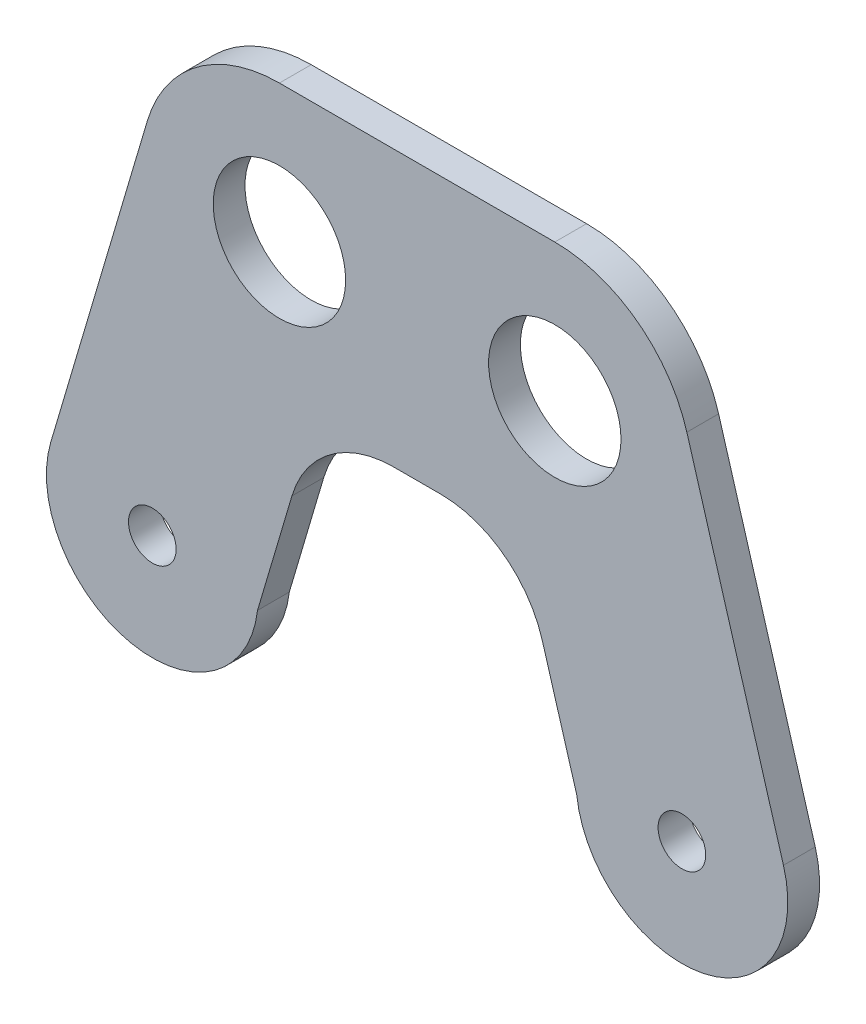
ISO-10303-21;
HEADER;
FILE_DESCRIPTION(('STEP AP214'),'2;1');
FILE_NAME('part.step','',(''),(''),'','','');
FILE_SCHEMA(('AUTOMOTIVE_DESIGN { 1 0 10303 214 1 1 1 1 }'));
ENDSEC;
DATA;
#1=APPLICATION_CONTEXT('core data for automotive mechanical design processes');
#2=APPLICATION_PROTOCOL_DEFINITION('international standard','automotive_design',2000,#1);
#3=PRODUCT_CONTEXT('',#1,'mechanical');
#4=PRODUCT('Part','Part','',(#3));
#5=PRODUCT_RELATED_PRODUCT_CATEGORY('part','',(#4));
#6=PRODUCT_DEFINITION_FORMATION('','',#4);
#7=PRODUCT_DEFINITION_CONTEXT('part definition',#1,'design');
#8=PRODUCT_DEFINITION('design','',#6,#7);
#9=PRODUCT_DEFINITION_SHAPE('','',#8);
#10=(LENGTH_UNIT() NAMED_UNIT(*) SI_UNIT(.MILLI.,.METRE.));
#11=(NAMED_UNIT(*) PLANE_ANGLE_UNIT() SI_UNIT($,.RADIAN.));
#12=(NAMED_UNIT(*) SI_UNIT($,.STERADIAN.) SOLID_ANGLE_UNIT());
#13=UNCERTAINTY_MEASURE_WITH_UNIT(LENGTH_MEASURE(1.E-05),#10,'distance_accuracy_value','');
#14=(GEOMETRIC_REPRESENTATION_CONTEXT(3) GLOBAL_UNCERTAINTY_ASSIGNED_CONTEXT((#13)) GLOBAL_UNIT_ASSIGNED_CONTEXT((#10,
#11,#12)) REPRESENTATION_CONTEXT('',''));
#15=CARTESIAN_POINT('',(0.,0.,0.));
#16=DIRECTION('',(0.,0.,1.));
#17=DIRECTION('',(1.,0.,0.));
#18=AXIS2_PLACEMENT_3D('',#15,#16,#17);
#19=CARTESIAN_POINT('',(12.,17.,3.));
#20=DIRECTION('',(0.,1.,0.));
#21=DIRECTION('',(0.,0.,1.));
#22=AXIS2_PLACEMENT_3D('',#19,#20,#21);
#23=PLANE('',#22);
#24=DIRECTION('',(1.,0.,0.));
#25=VECTOR('',#24,1.);
#26=CARTESIAN_POINT('',(12.,17.,0.));
#27=LINE('',#26,#25);
#28=CARTESIAN_POINT('',(22.7724449466976,17.,0.));
#29=VERTEX_POINT('',#28);
#30=CARTESIAN_POINT('',(27.2275550533024,17.,0.));
#31=VERTEX_POINT('',#30);
#32=EDGE_CURVE('E216',#29,#31,#27,.T.);
#33=ORIENTED_EDGE('',*,*,#32,.T.);
#34=DIRECTION('',(0.,0.,1.));
#35=VECTOR('',#34,1.);
#36=CARTESIAN_POINT('',(27.2275550533024,17.,3.));
#37=LINE('',#36,#35);
#38=CARTESIAN_POINT('',(27.2275550533024,17.,3.));
#39=VERTEX_POINT('',#38);
#40=EDGE_CURVE('E274',#31,#39,#37,.T.);
#41=ORIENTED_EDGE('',*,*,#40,.T.);
#42=DIRECTION('',(1.,0.,0.));
#43=VECTOR('',#42,1.);
#44=CARTESIAN_POINT('',(12.,17.,3.));
#45=LINE('',#44,#43);
#46=CARTESIAN_POINT('',(22.7724449466976,17.,3.));
#47=VERTEX_POINT('',#46);
#48=EDGE_CURVE('E202',#47,#39,#45,.T.);
#49=ORIENTED_EDGE('',*,*,#48,.F.);
#50=DIRECTION('',(0.,0.,1.));
#51=VECTOR('',#50,1.);
#52=CARTESIAN_POINT('',(22.7724449466976,17.,3.));
#53=LINE('',#52,#51);
#54=EDGE_CURVE('E268',#47,#29,#53,.F.);
#55=ORIENTED_EDGE('',*,*,#54,.T.);
#56=EDGE_LOOP('',(#33,#41,#49,#55));
#57=FACE_BOUND('',#56,.T.);
#58=ADVANCED_FACE('F39',(#57),#23,.F.);
#59=CARTESIAN_POINT('',(0.,0.,3.));
#60=DIRECTION('',(0.,0.,1.));
#61=DIRECTION('',(1.,0.,0.));
#62=AXIS2_PLACEMENT_3D('',#59,#60,#61);
#63=PLANE('',#62);
#64=CARTESIAN_POINT('',(0.,0.,3.));
#65=DIRECTION('',(0.,0.,1.));
#66=DIRECTION('',(1.,0.,0.));
#67=AXIS2_PLACEMENT_3D('',#64,#65,#66);
#68=CIRCLE('',#67,10.);
#69=CARTESIAN_POINT('',(-9.58948732307208,2.83579492922883,3.));
#70=VERTEX_POINT('',#69);
#71=CARTESIAN_POINT('',(9.93327257681354,-1.15329784302411,3.));
#72=VERTEX_POINT('',#71);
#73=EDGE_CURVE('E264',#70,#72,#68,.T.);
#74=ORIENTED_EDGE('',*,*,#73,.T.);
#75=DIRECTION('',(0.283579492922883,0.958948732307208,0.));
#76=VECTOR('',#75,1.);
#77=CARTESIAN_POINT('',(9.44809106389425,-2.79398134928659,3.));
#78=LINE('',#77,#76);
#79=CARTESIAN_POINT('',(13.1829576236255,9.83579492922883,3.));
#80=VERTEX_POINT('',#79);
#81=EDGE_CURVE('E231',#72,#80,#78,.T.);
#82=ORIENTED_EDGE('',*,*,#81,.T.);
#83=CARTESIAN_POINT('',(22.7724449466976,7.,3.));
#84=DIRECTION('',(0.,0.,1.));
#85=DIRECTION('',(1.,0.,0.));
#86=AXIS2_PLACEMENT_3D('',#83,#84,#85);
#87=CIRCLE('',#86,10.);
#88=EDGE_CURVE('E48',#80,#47,#87,.F.);
#89=ORIENTED_EDGE('',*,*,#88,.T.);
#90=ORIENTED_EDGE('',*,*,#48,.T.);
#91=CARTESIAN_POINT('',(27.2275550533024,7.,3.));
#92=DIRECTION('',(0.,0.,1.));
#93=DIRECTION('',(1.,0.,0.));
#94=AXIS2_PLACEMENT_3D('',#91,#92,#93);
#95=CIRCLE('',#94,10.);
#96=CARTESIAN_POINT('',(36.8170423763745,9.83579492922883,3.));
#97=VERTEX_POINT('',#96);
#98=EDGE_CURVE('E284',#39,#97,#95,.F.);
#99=ORIENTED_EDGE('',*,*,#98,.T.);
#100=DIRECTION('',(-0.283579492922883,0.958948732307208,0.));
#101=VECTOR('',#100,1.);
#102=CARTESIAN_POINT('',(36.5310424957858,10.8029284130494,3.));
#103=LINE('',#102,#101);
#104=CARTESIAN_POINT('',(40.0667274231865,-1.15329784302412,3.));
#105=VERTEX_POINT('',#104);
#106=EDGE_CURVE('E163',#105,#97,#103,.T.);
#107=ORIENTED_EDGE('',*,*,#106,.F.);
#108=CARTESIAN_POINT('',(50.,0.,3.));
#109=DIRECTION('',(0.,0.,1.));
#110=DIRECTION('',(1.,0.,0.));
#111=AXIS2_PLACEMENT_3D('',#108,#109,#110);
#112=CIRCLE('',#111,10.);
#113=CARTESIAN_POINT('',(59.5894873230721,2.83579492922883,3.));
#114=VERTEX_POINT('',#113);
#115=EDGE_CURVE('E158',#105,#114,#112,.T.);
#116=ORIENTED_EDGE('',*,*,#115,.T.);
#117=DIRECTION('',(0.283579492922883,-0.958948732307208,0.));
#118=VECTOR('',#117,1.);
#119=CARTESIAN_POINT('',(55.5686208827521,16.4327046915648,3.));
#120=LINE('',#119,#118);
#121=CARTESIAN_POINT('',(50.4663335199937,33.6865334079975,3.));
#122=VERTEX_POINT('',#121);
#123=EDGE_CURVE('E134',#122,#114,#120,.T.);
#124=ORIENTED_EDGE('',*,*,#123,.F.);
#125=CARTESIAN_POINT('',(38.,30.,3.));
#126=DIRECTION('',(0.,0.,1.));
#127=DIRECTION('',(1.,0.,0.));
#128=AXIS2_PLACEMENT_3D('',#125,#126,#127);
#129=CIRCLE('',#128,13.);
#130=CARTESIAN_POINT('',(38.,43.,3.));
#131=VERTEX_POINT('',#130);
#132=EDGE_CURVE('E207',#122,#131,#129,.T.);
#133=ORIENTED_EDGE('',*,*,#132,.T.);
#134=DIRECTION('',(-1.,0.,0.));
#135=VECTOR('',#134,1.);
#136=CARTESIAN_POINT('',(12.,43.,3.));
#137=LINE('',#136,#135);
#138=CARTESIAN_POINT('',(12.,43.,3.));
#139=VERTEX_POINT('',#138);
#140=EDGE_CURVE('E210',#131,#139,#137,.T.);
#141=ORIENTED_EDGE('',*,*,#140,.T.);
#142=CARTESIAN_POINT('',(12.,30.,3.));
#143=DIRECTION('',(0.,0.,1.));
#144=DIRECTION('',(1.,0.,0.));
#145=AXIS2_PLACEMENT_3D('',#142,#143,#144);
#146=CIRCLE('',#145,13.);
#147=CARTESIAN_POINT('',(-0.4663335199937,33.6865334079975,3.));
#148=VERTEX_POINT('',#147);
#149=EDGE_CURVE('E198',#139,#148,#146,.T.);
#150=ORIENTED_EDGE('',*,*,#149,.T.);
#151=DIRECTION('',(-0.283579492922883,-0.958948732307208,0.));
#152=VECTOR('',#151,1.);
#153=CARTESIAN_POINT('',(-9.58948732307208,2.83579492922883,3.));
#154=LINE('',#153,#152);
#155=EDGE_CURVE('E236',#148,#70,#154,.T.);
#156=ORIENTED_EDGE('',*,*,#155,.T.);
#157=EDGE_LOOP('',(#74,#82,#89,#90,#99,#107,#116,#124,#133,#141,#150,#156));
#158=FACE_BOUND('',#157,.T.);
#159=CARTESIAN_POINT('',(0.,0.,3.));
#160=DIRECTION('',(0.,0.,1.));
#161=DIRECTION('',(1.,0.,0.));
#162=AXIS2_PLACEMENT_3D('',#159,#160,#161);
#163=CIRCLE('',#162,2.25);
#164=CARTESIAN_POINT('',(2.25,0.,3.));
#165=VERTEX_POINT('',#164);
#166=EDGE_CURVE('E256',#165,#165,#163,.T.);
#167=ORIENTED_EDGE('',*,*,#166,.F.);
#168=EDGE_LOOP('',(#167));
#169=FACE_BOUND('',#168,.T.);
#170=CARTESIAN_POINT('',(12.,30.,3.));
#171=DIRECTION('',(0.,0.,1.));
#172=DIRECTION('',(1.,0.,0.));
#173=AXIS2_PLACEMENT_3D('',#170,#171,#172);
#174=CIRCLE('',#173,6.25);
#175=CARTESIAN_POINT('',(18.25,30.,3.));
#176=VERTEX_POINT('',#175);
#177=EDGE_CURVE('E190',#176,#176,#174,.T.);
#178=ORIENTED_EDGE('',*,*,#177,.F.);
#179=EDGE_LOOP('',(#178));
#180=FACE_BOUND('',#179,.T.);
#181=CARTESIAN_POINT('',(38.,30.,3.));
#182=DIRECTION('',(0.,0.,1.));
#183=DIRECTION('',(1.,0.,0.));
#184=AXIS2_PLACEMENT_3D('',#181,#182,#183);
#185=CIRCLE('',#184,6.25000000000001);
#186=CARTESIAN_POINT('',(44.25,30.,3.));
#187=VERTEX_POINT('',#186);
#188=EDGE_CURVE('E182',#187,#187,#185,.T.);
#189=ORIENTED_EDGE('',*,*,#188,.F.);
#190=EDGE_LOOP('',(#189));
#191=FACE_BOUND('',#190,.T.);
#192=CARTESIAN_POINT('',(50.,0.,3.));
#193=DIRECTION('',(0.,0.,1.));
#194=DIRECTION('',(1.,0.,0.));
#195=AXIS2_PLACEMENT_3D('',#192,#193,#194);
#196=CIRCLE('',#195,2.25);
#197=CARTESIAN_POINT('',(52.25,0.,3.));
#198=VERTEX_POINT('',#197);
#199=EDGE_CURVE('E159',#198,#198,#196,.T.);
#200=ORIENTED_EDGE('',*,*,#199,.F.);
#201=EDGE_LOOP('',(#200));
#202=FACE_BOUND('',#201,.T.);
#203=ADVANCED_FACE('F292',(#158,#169,#180,#191,#202),#63,.T.);
#204=CARTESIAN_POINT('',(0.,0.,0.));
#205=DIRECTION('',(0.,0.,1.));
#206=DIRECTION('',(1.,0.,0.));
#207=AXIS2_PLACEMENT_3D('',#204,#205,#206);
#208=PLANE('',#207);
#209=CARTESIAN_POINT('',(0.,0.,0.));
#210=DIRECTION('',(0.,0.,1.));
#211=DIRECTION('',(1.,0.,0.));
#212=AXIS2_PLACEMENT_3D('',#209,#210,#211);
#213=CIRCLE('',#212,10.);
#214=CARTESIAN_POINT('',(-9.58948732307208,2.83579492922883,0.));
#215=VERTEX_POINT('',#214);
#216=CARTESIAN_POINT('',(9.93327257681354,-1.15329784302411,0.));
#217=VERTEX_POINT('',#216);
#218=EDGE_CURVE('E260',#215,#217,#213,.T.);
#219=ORIENTED_EDGE('',*,*,#218,.F.);
#220=DIRECTION('',(-0.283579492922883,-0.958948732307208,0.));
#221=VECTOR('',#220,1.);
#222=CARTESIAN_POINT('',(-9.58948732307208,2.83579492922883,0.));
#223=LINE('',#222,#221);
#224=CARTESIAN_POINT('',(-0.4663335199937,33.6865334079975,0.));
#225=VERTEX_POINT('',#224);
#226=EDGE_CURVE('E235',#225,#215,#223,.T.);
#227=ORIENTED_EDGE('',*,*,#226,.F.);
#228=CARTESIAN_POINT('',(12.,30.,0.));
#229=DIRECTION('',(0.,0.,1.));
#230=DIRECTION('',(1.,0.,0.));
#231=AXIS2_PLACEMENT_3D('',#228,#229,#230);
#232=CIRCLE('',#231,13.);
#233=CARTESIAN_POINT('',(12.,43.,0.));
#234=VERTEX_POINT('',#233);
#235=EDGE_CURVE('E194',#234,#225,#232,.T.);
#236=ORIENTED_EDGE('',*,*,#235,.F.);
#237=DIRECTION('',(-1.,0.,0.));
#238=VECTOR('',#237,1.);
#239=CARTESIAN_POINT('',(12.,43.,0.));
#240=LINE('',#239,#238);
#241=CARTESIAN_POINT('',(38.,43.,0.));
#242=VERTEX_POINT('',#241);
#243=EDGE_CURVE('E203',#242,#234,#240,.T.);
#244=ORIENTED_EDGE('',*,*,#243,.F.);
#245=CARTESIAN_POINT('',(38.,30.,0.));
#246=DIRECTION('',(0.,0.,1.));
#247=DIRECTION('',(1.,0.,0.));
#248=AXIS2_PLACEMENT_3D('',#245,#246,#247);
#249=CIRCLE('',#248,13.);
#250=CARTESIAN_POINT('',(50.4663335199937,33.6865334079975,0.));
#251=VERTEX_POINT('',#250);
#252=EDGE_CURVE('E151',#251,#242,#249,.T.);
#253=ORIENTED_EDGE('',*,*,#252,.F.);
#254=DIRECTION('',(0.283579492922883,-0.958948732307208,0.));
#255=VECTOR('',#254,1.);
#256=CARTESIAN_POINT('',(55.5686208827521,16.4327046915648,0.));
#257=LINE('',#256,#255);
#258=CARTESIAN_POINT('',(59.5894873230721,2.83579492922883,0.));
#259=VERTEX_POINT('',#258);
#260=EDGE_CURVE('E132',#251,#259,#257,.T.);
#261=ORIENTED_EDGE('',*,*,#260,.T.);
#262=CARTESIAN_POINT('',(50.,0.,0.));
#263=DIRECTION('',(0.,0.,1.));
#264=DIRECTION('',(1.,0.,0.));
#265=AXIS2_PLACEMENT_3D('',#262,#263,#264);
#266=CIRCLE('',#265,10.);
#267=CARTESIAN_POINT('',(40.0667274231865,-1.15329784302412,0.));
#268=VERTEX_POINT('',#267);
#269=EDGE_CURVE('E149',#268,#259,#266,.T.);
#270=ORIENTED_EDGE('',*,*,#269,.F.);
#271=DIRECTION('',(-0.283579492922883,0.958948732307208,0.));
#272=VECTOR('',#271,1.);
#273=CARTESIAN_POINT('',(36.5310424957858,10.8029284130494,0.));
#274=LINE('',#273,#272);
#275=CARTESIAN_POINT('',(36.8170423763745,9.83579492922883,0.));
#276=VERTEX_POINT('',#275);
#277=EDGE_CURVE('E153',#268,#276,#274,.T.);
#278=ORIENTED_EDGE('',*,*,#277,.T.);
#279=CARTESIAN_POINT('',(27.2275550533024,7.,0.));
#280=DIRECTION('',(0.,0.,1.));
#281=DIRECTION('',(1.,0.,0.));
#282=AXIS2_PLACEMENT_3D('',#279,#280,#281);
#283=CIRCLE('',#282,10.);
#284=EDGE_CURVE('E287',#276,#31,#283,.T.);
#285=ORIENTED_EDGE('',*,*,#284,.T.);
#286=ORIENTED_EDGE('',*,*,#32,.F.);
#287=CARTESIAN_POINT('',(22.7724449466976,7.,0.));
#288=DIRECTION('',(0.,0.,1.));
#289=DIRECTION('',(1.,0.,0.));
#290=AXIS2_PLACEMENT_3D('',#287,#288,#289);
#291=CIRCLE('',#290,10.);
#292=CARTESIAN_POINT('',(13.1829576236255,9.83579492922883,0.));
#293=VERTEX_POINT('',#292);
#294=EDGE_CURVE('E11',#29,#293,#291,.T.);
#295=ORIENTED_EDGE('',*,*,#294,.T.);
#296=DIRECTION('',(0.283579492922883,0.958948732307208,0.));
#297=VECTOR('',#296,1.);
#298=CARTESIAN_POINT('',(9.44809106389425,-2.79398134928659,0.));
#299=LINE('',#298,#297);
#300=EDGE_CURVE('E232',#217,#293,#299,.T.);
#301=ORIENTED_EDGE('',*,*,#300,.F.);
#302=EDGE_LOOP('',(#219,#227,#236,#244,#253,#261,#270,#278,#285,#286,#295,#301));
#303=FACE_BOUND('',#302,.T.);
#304=CARTESIAN_POINT('',(0.,0.,0.));
#305=DIRECTION('',(0.,0.,1.));
#306=DIRECTION('',(1.,0.,0.));
#307=AXIS2_PLACEMENT_3D('',#304,#305,#306);
#308=CIRCLE('',#307,2.25);
#309=CARTESIAN_POINT('',(2.25,0.,0.));
#310=VERTEX_POINT('',#309);
#311=EDGE_CURVE('E249',#310,#310,#308,.T.);
#312=ORIENTED_EDGE('',*,*,#311,.T.);
#313=EDGE_LOOP('',(#312));
#314=FACE_BOUND('',#313,.T.);
#315=CARTESIAN_POINT('',(12.,30.,0.));
#316=DIRECTION('',(0.,0.,1.));
#317=DIRECTION('',(1.,0.,0.));
#318=AXIS2_PLACEMENT_3D('',#315,#316,#317);
#319=CIRCLE('',#318,6.25);
#320=CARTESIAN_POINT('',(18.25,30.,0.));
#321=VERTEX_POINT('',#320);
#322=EDGE_CURVE('E186',#321,#321,#319,.T.);
#323=ORIENTED_EDGE('',*,*,#322,.T.);
#324=EDGE_LOOP('',(#323));
#325=FACE_BOUND('',#324,.T.);
#326=CARTESIAN_POINT('',(38.,30.,0.));
#327=DIRECTION('',(0.,0.,1.));
#328=DIRECTION('',(1.,0.,0.));
#329=AXIS2_PLACEMENT_3D('',#326,#327,#328);
#330=CIRCLE('',#329,6.25000000000001);
#331=CARTESIAN_POINT('',(44.25,30.,0.));
#332=VERTEX_POINT('',#331);
#333=EDGE_CURVE('E178',#332,#332,#330,.T.);
#334=ORIENTED_EDGE('',*,*,#333,.T.);
#335=EDGE_LOOP('',(#334));
#336=FACE_BOUND('',#335,.T.);
#337=CARTESIAN_POINT('',(50.,0.,0.));
#338=DIRECTION('',(0.,0.,1.));
#339=DIRECTION('',(1.,0.,0.));
#340=AXIS2_PLACEMENT_3D('',#337,#338,#339);
#341=CIRCLE('',#340,2.25);
#342=CARTESIAN_POINT('',(52.25,0.,0.));
#343=VERTEX_POINT('',#342);
#344=EDGE_CURVE('E166',#343,#343,#341,.T.);
#345=ORIENTED_EDGE('',*,*,#344,.T.);
#346=EDGE_LOOP('',(#345));
#347=FACE_BOUND('',#346,.T.);
#348=ADVANCED_FACE('F146',(#303,#314,#325,#336,#347),#208,.F.);
#349=CARTESIAN_POINT('',(0.,0.,3.));
#350=DIRECTION('',(0.,0.,-1.));
#351=DIRECTION('',(-1.,0.,0.));
#352=AXIS2_PLACEMENT_3D('',#349,#350,#351);
#353=CYLINDRICAL_SURFACE('',#352,10.);
#354=ORIENTED_EDGE('',*,*,#73,.F.);
#355=DIRECTION('',(0.,0.,1.));
#356=VECTOR('',#355,1.);
#357=CARTESIAN_POINT('',(-9.58948732307208,2.83579492922883,0.));
#358=LINE('',#357,#356);
#359=EDGE_CURVE('E245',#215,#70,#358,.T.);
#360=ORIENTED_EDGE('',*,*,#359,.F.);
#361=ORIENTED_EDGE('',*,*,#218,.T.);
#362=DIRECTION('',(0.,0.,1.));
#363=VECTOR('',#362,1.);
#364=CARTESIAN_POINT('',(9.93327257681354,-1.15329784302411,0.));
#365=LINE('',#364,#363);
#366=EDGE_CURVE('E239',#217,#72,#365,.T.);
#367=ORIENTED_EDGE('',*,*,#366,.T.);
#368=EDGE_LOOP('',(#354,#360,#361,#367));
#369=FACE_BOUND('',#368,.T.);
#370=ADVANCED_FACE('F302',(#369),#353,.T.);
#371=CARTESIAN_POINT('',(0.,0.,3.));
#372=DIRECTION('',(0.,0.,-1.));
#373=DIRECTION('',(-1.,0.,0.));
#374=AXIS2_PLACEMENT_3D('',#371,#372,#373);
#375=CYLINDRICAL_SURFACE('',#374,2.25);
#376=ORIENTED_EDGE('',*,*,#166,.T.);
#377=EDGE_LOOP('',(#376));
#378=FACE_BOUND('',#377,.T.);
#379=ORIENTED_EDGE('',*,*,#311,.F.);
#380=EDGE_LOOP('',(#379));
#381=FACE_BOUND('',#380,.T.);
#382=ADVANCED_FACE('F348',(#378,#381),#375,.F.);
#383=CARTESIAN_POINT('',(-9.58948732307208,2.83579492922883,0.));
#384=DIRECTION('',(-0.958948732307208,0.283579492922883,0.));
#385=DIRECTION('',(-0.283579492922883,-0.958948732307208,0.));
#386=AXIS2_PLACEMENT_3D('',#383,#384,#385);
#387=PLANE('',#386);
#388=ORIENTED_EDGE('',*,*,#155,.F.);
#389=DIRECTION('',(0.,0.,1.));
#390=VECTOR('',#389,1.);
#391=CARTESIAN_POINT('',(-0.466333519993704,33.6865334079975,0.));
#392=LINE('',#391,#390);
#393=EDGE_CURVE('E250',#225,#148,#392,.T.);
#394=ORIENTED_EDGE('',*,*,#393,.F.);
#395=ORIENTED_EDGE('',*,*,#226,.T.);
#396=ORIENTED_EDGE('',*,*,#359,.T.);
#397=EDGE_LOOP('',(#388,#394,#395,#396));
#398=FACE_BOUND('',#397,.T.);
#399=ADVANCED_FACE('F305',(#398),#387,.T.);
#400=CARTESIAN_POINT('',(9.44809106389425,-2.79398134928659,0.));
#401=DIRECTION('',(0.958948732307208,-0.283579492922883,0.));
#402=DIRECTION('',(0.283579492922883,0.958948732307208,0.));
#403=AXIS2_PLACEMENT_3D('',#400,#401,#402);
#404=PLANE('',#403);
#405=ORIENTED_EDGE('',*,*,#300,.T.);
#406=DIRECTION('',(0.,0.,1.));
#407=VECTOR('',#406,1.);
#408=CARTESIAN_POINT('',(13.1829576236255,9.83579492922883,0.));
#409=LINE('',#408,#407);
#410=EDGE_CURVE('E281',#293,#80,#409,.T.);
#411=ORIENTED_EDGE('',*,*,#410,.T.);
#412=ORIENTED_EDGE('',*,*,#81,.F.);
#413=ORIENTED_EDGE('',*,*,#366,.F.);
#414=EDGE_LOOP('',(#405,#411,#412,#413));
#415=FACE_BOUND('',#414,.T.);
#416=ADVANCED_FACE('F297',(#415),#404,.T.);
#417=CARTESIAN_POINT('',(12.,30.,3.));
#418=DIRECTION('',(0.,0.,-1.));
#419=DIRECTION('',(-1.,0.,0.));
#420=AXIS2_PLACEMENT_3D('',#417,#418,#419);
#421=CYLINDRICAL_SURFACE('',#420,13.);
#422=ORIENTED_EDGE('',*,*,#235,.T.);
#423=ORIENTED_EDGE('',*,*,#393,.T.);
#424=ORIENTED_EDGE('',*,*,#149,.F.);
#425=DIRECTION('',(0.,0.,-1.));
#426=VECTOR('',#425,1.);
#427=CARTESIAN_POINT('',(12.,43.,3.));
#428=LINE('',#427,#426);
#429=EDGE_CURVE('E213',#139,#234,#428,.T.);
#430=ORIENTED_EDGE('',*,*,#429,.T.);
#431=EDGE_LOOP('',(#422,#423,#424,#430));
#432=FACE_BOUND('',#431,.T.);
#433=ADVANCED_FACE('F309',(#432),#421,.T.);
#434=CARTESIAN_POINT('',(38.,30.,3.));
#435=DIRECTION('',(0.,0.,-1.));
#436=DIRECTION('',(-1.,0.,0.));
#437=AXIS2_PLACEMENT_3D('',#434,#435,#436);
#438=CYLINDRICAL_SURFACE('',#437,13.);
#439=ORIENTED_EDGE('',*,*,#132,.F.);
#440=DIRECTION('',(0.,0.,1.));
#441=VECTOR('',#440,1.);
#442=CARTESIAN_POINT('',(50.4663335199937,33.6865334079975,0.));
#443=LINE('',#442,#441);
#444=EDGE_CURVE('E140',#251,#122,#443,.T.);
#445=ORIENTED_EDGE('',*,*,#444,.F.);
#446=ORIENTED_EDGE('',*,*,#252,.T.);
#447=DIRECTION('',(0.,0.,-1.));
#448=VECTOR('',#447,1.);
#449=CARTESIAN_POINT('',(38.,43.,3.));
#450=LINE('',#449,#448);
#451=EDGE_CURVE('E227',#131,#242,#450,.T.);
#452=ORIENTED_EDGE('',*,*,#451,.F.);
#453=EDGE_LOOP('',(#439,#445,#446,#452));
#454=FACE_BOUND('',#453,.T.);
#455=ADVANCED_FACE('F318',(#454),#438,.T.);
#456=CARTESIAN_POINT('',(12.,43.,3.));
#457=DIRECTION('',(0.,-1.,0.));
#458=DIRECTION('',(0.,0.,-1.));
#459=AXIS2_PLACEMENT_3D('',#456,#457,#458);
#460=PLANE('',#459);
#461=ORIENTED_EDGE('',*,*,#243,.T.);
#462=ORIENTED_EDGE('',*,*,#429,.F.);
#463=ORIENTED_EDGE('',*,*,#140,.F.);
#464=ORIENTED_EDGE('',*,*,#451,.T.);
#465=EDGE_LOOP('',(#461,#462,#463,#464));
#466=FACE_BOUND('',#465,.T.);
#467=ADVANCED_FACE('F314',(#466),#460,.F.);
#468=CARTESIAN_POINT('',(12.,30.,3.));
#469=DIRECTION('',(0.,0.,-1.));
#470=DIRECTION('',(-1.,0.,0.));
#471=AXIS2_PLACEMENT_3D('',#468,#469,#470);
#472=CYLINDRICAL_SURFACE('',#471,6.25);
#473=ORIENTED_EDGE('',*,*,#177,.T.);
#474=EDGE_LOOP('',(#473));
#475=FACE_BOUND('',#474,.T.);
#476=ORIENTED_EDGE('',*,*,#322,.F.);
#477=EDGE_LOOP('',(#476));
#478=FACE_BOUND('',#477,.T.);
#479=ADVANCED_FACE('F388',(#475,#478),#472,.F.);
#480=CARTESIAN_POINT('',(38.,30.,3.));
#481=DIRECTION('',(0.,0.,-1.));
#482=DIRECTION('',(-1.,0.,0.));
#483=AXIS2_PLACEMENT_3D('',#480,#481,#482);
#484=CYLINDRICAL_SURFACE('',#483,6.25000000000001);
#485=ORIENTED_EDGE('',*,*,#188,.T.);
#486=EDGE_LOOP('',(#485));
#487=FACE_BOUND('',#486,.T.);
#488=ORIENTED_EDGE('',*,*,#333,.F.);
#489=EDGE_LOOP('',(#488));
#490=FACE_BOUND('',#489,.T.);
#491=ADVANCED_FACE('F394',(#487,#490),#484,.F.);
#492=CARTESIAN_POINT('',(36.5310424957858,10.8029284130494,0.));
#493=DIRECTION('',(0.958948732307208,0.283579492922883,0.));
#494=DIRECTION('',(-0.283579492922883,0.958948732307208,0.));
#495=AXIS2_PLACEMENT_3D('',#492,#493,#494);
#496=PLANE('',#495);
#497=ORIENTED_EDGE('',*,*,#106,.T.);
#498=DIRECTION('',(0.,0.,1.));
#499=VECTOR('',#498,1.);
#500=CARTESIAN_POINT('',(36.8170423763745,9.83579492922883,0.));
#501=LINE('',#500,#499);
#502=EDGE_CURVE('E278',#97,#276,#501,.F.);
#503=ORIENTED_EDGE('',*,*,#502,.T.);
#504=ORIENTED_EDGE('',*,*,#277,.F.);
#505=DIRECTION('',(0.,0.,1.));
#506=VECTOR('',#505,1.);
#507=CARTESIAN_POINT('',(40.0667274231865,-1.15329784302412,0.));
#508=LINE('',#507,#506);
#509=EDGE_CURVE('E141',#268,#105,#508,.T.);
#510=ORIENTED_EDGE('',*,*,#509,.T.);
#511=EDGE_LOOP('',(#497,#503,#504,#510));
#512=FACE_BOUND('',#511,.T.);
#513=ADVANCED_FACE('F322',(#512),#496,.F.);
#514=CARTESIAN_POINT('',(55.5686208827521,16.4327046915648,0.));
#515=DIRECTION('',(-0.958948732307208,-0.283579492922883,0.));
#516=DIRECTION('',(0.283579492922883,-0.958948732307208,0.));
#517=AXIS2_PLACEMENT_3D('',#514,#515,#516);
#518=PLANE('',#517);
#519=ORIENTED_EDGE('',*,*,#123,.T.);
#520=DIRECTION('',(0.,0.,1.));
#521=VECTOR('',#520,1.);
#522=CARTESIAN_POINT('',(59.5894873230721,2.83579492922883,0.));
#523=LINE('',#522,#521);
#524=EDGE_CURVE('E128',#259,#114,#523,.T.);
#525=ORIENTED_EDGE('',*,*,#524,.F.);
#526=ORIENTED_EDGE('',*,*,#260,.F.);
#527=ORIENTED_EDGE('',*,*,#444,.T.);
#528=EDGE_LOOP('',(#519,#525,#526,#527));
#529=FACE_BOUND('',#528,.T.);
#530=ADVANCED_FACE('F130',(#529),#518,.F.);
#531=CARTESIAN_POINT('',(50.,0.,3.));
#532=DIRECTION('',(0.,0.,-1.));
#533=DIRECTION('',(-1.,0.,0.));
#534=AXIS2_PLACEMENT_3D('',#531,#532,#533);
#535=CYLINDRICAL_SURFACE('',#534,10.);
#536=ORIENTED_EDGE('',*,*,#115,.F.);
#537=ORIENTED_EDGE('',*,*,#509,.F.);
#538=ORIENTED_EDGE('',*,*,#269,.T.);
#539=ORIENTED_EDGE('',*,*,#524,.T.);
#540=EDGE_LOOP('',(#536,#537,#538,#539));
#541=FACE_BOUND('',#540,.T.);
#542=ADVANCED_FACE('F156',(#541),#535,.T.);
#543=CARTESIAN_POINT('',(50.,0.,3.));
#544=DIRECTION('',(0.,0.,-1.));
#545=DIRECTION('',(-1.,0.,0.));
#546=AXIS2_PLACEMENT_3D('',#543,#544,#545);
#547=CYLINDRICAL_SURFACE('',#546,2.25);
#548=ORIENTED_EDGE('',*,*,#199,.T.);
#549=EDGE_LOOP('',(#548));
#550=FACE_BOUND('',#549,.T.);
#551=ORIENTED_EDGE('',*,*,#344,.F.);
#552=EDGE_LOOP('',(#551));
#553=FACE_BOUND('',#552,.T.);
#554=ADVANCED_FACE('F327',(#550,#553),#547,.F.);
#555=CARTESIAN_POINT('',(27.2275550533024,7.,3.));
#556=DIRECTION('',(0.,0.,-1.));
#557=DIRECTION('',(-1.,0.,0.));
#558=AXIS2_PLACEMENT_3D('',#555,#556,#557);
#559=CYLINDRICAL_SURFACE('',#558,10.);
#560=ORIENTED_EDGE('',*,*,#284,.F.);
#561=ORIENTED_EDGE('',*,*,#502,.F.);
#562=ORIENTED_EDGE('',*,*,#98,.F.);
#563=ORIENTED_EDGE('',*,*,#40,.F.);
#564=EDGE_LOOP('',(#560,#561,#562,#563));
#565=FACE_BOUND('',#564,.T.);
#566=ADVANCED_FACE('F325',(#565),#559,.F.);
#567=CARTESIAN_POINT('',(22.7724449466976,7.,0.));
#568=DIRECTION('',(0.,0.,1.));
#569=DIRECTION('',(1.,0.,0.));
#570=AXIS2_PLACEMENT_3D('',#567,#568,#569);
#571=CYLINDRICAL_SURFACE('',#570,10.);
#572=ORIENTED_EDGE('',*,*,#294,.F.);
#573=ORIENTED_EDGE('',*,*,#54,.F.);
#574=ORIENTED_EDGE('',*,*,#88,.F.);
#575=ORIENTED_EDGE('',*,*,#410,.F.);
#576=EDGE_LOOP('',(#572,#573,#574,#575));
#577=FACE_BOUND('',#576,.T.);
#578=ADVANCED_FACE('F41',(#577),#571,.F.);
#579=CLOSED_SHELL('',(#58,#203,#348,#370,#382,#399,#416,#433,#455,#467,#479,#491,#513,#530,#542,
#554,#566,#578));
#580=MANIFOLD_SOLID_BREP('B2',#579);
#581=ADVANCED_BREP_SHAPE_REPRESENTATION('',(#18,#580),#14);
#582=SHAPE_DEFINITION_REPRESENTATION(#9,#581);
ENDSEC;
END-ISO-10303-21;
